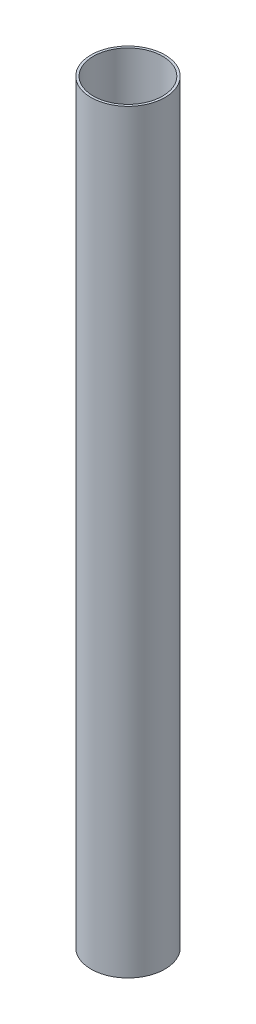
ISO-10303-21;
HEADER;
FILE_DESCRIPTION(('STEP AP214'),'2;1');
FILE_NAME('part.step','',(''),(''),'','','');
FILE_SCHEMA(('AUTOMOTIVE_DESIGN { 1 0 10303 214 1 1 1 1 }'));
ENDSEC;
DATA;
#1=APPLICATION_CONTEXT('core data for automotive mechanical design processes');
#2=APPLICATION_PROTOCOL_DEFINITION('international standard','automotive_design',2000,#1);
#3=PRODUCT_CONTEXT('',#1,'mechanical');
#4=PRODUCT('Part','Part','',(#3));
#5=PRODUCT_RELATED_PRODUCT_CATEGORY('part','',(#4));
#6=PRODUCT_DEFINITION_FORMATION('','',#4);
#7=PRODUCT_DEFINITION_CONTEXT('part definition',#1,'design');
#8=PRODUCT_DEFINITION('design','',#6,#7);
#9=PRODUCT_DEFINITION_SHAPE('','',#8);
#10=(LENGTH_UNIT() NAMED_UNIT(*) SI_UNIT(.MILLI.,.METRE.));
#11=(NAMED_UNIT(*) PLANE_ANGLE_UNIT() SI_UNIT($,.RADIAN.));
#12=(NAMED_UNIT(*) SI_UNIT($,.STERADIAN.) SOLID_ANGLE_UNIT());
#13=UNCERTAINTY_MEASURE_WITH_UNIT(LENGTH_MEASURE(1.E-05),#10,'distance_accuracy_value','');
#14=(GEOMETRIC_REPRESENTATION_CONTEXT(3) GLOBAL_UNCERTAINTY_ASSIGNED_CONTEXT((#13)) GLOBAL_UNIT_ASSIGNED_CONTEXT((#10,
#11,#12)) REPRESENTATION_CONTEXT('',''));
#15=CARTESIAN_POINT('',(0.,0.,0.));
#16=DIRECTION('',(0.,0.,1.));
#17=DIRECTION('',(1.,0.,0.));
#18=AXIS2_PLACEMENT_3D('',#15,#16,#17);
#19=CARTESIAN_POINT('',(0.,936.625,0.));
#20=DIRECTION('',(0.,1.,0.));
#21=DIRECTION('',(0.,0.,1.));
#22=AXIS2_PLACEMENT_3D('',#19,#20,#21);
#23=PLANE('',#22);
#24=CARTESIAN_POINT('',(0.,936.625,0.));
#25=DIRECTION('',(0.,1.,0.));
#26=DIRECTION('',(0.,0.,1.));
#27=AXIS2_PLACEMENT_3D('',#24,#25,#26);
#28=CIRCLE('',#27,45.847);
#29=CARTESIAN_POINT('',(0.,936.625,45.847));
#30=VERTEX_POINT('',#29);
#31=EDGE_CURVE('E10',#30,#30,#28,.T.);
#32=ORIENTED_EDGE('',*,*,#31,.T.);
#33=EDGE_LOOP('',(#32));
#34=FACE_BOUND('',#33,.T.);
#35=CARTESIAN_POINT('',(0.,936.625,0.));
#36=DIRECTION('',(0.,1.,0.));
#37=DIRECTION('',(0.,0.,1.));
#38=AXIS2_PLACEMENT_3D('',#35,#36,#37);
#39=CIRCLE('',#38,42.926);
#40=CARTESIAN_POINT('',(0.,936.625,42.926));
#41=VERTEX_POINT('',#40);
#42=EDGE_CURVE('E43',#41,#41,#39,.T.);
#43=ORIENTED_EDGE('',*,*,#42,.F.);
#44=EDGE_LOOP('',(#43));
#45=FACE_BOUND('',#44,.T.);
#46=ADVANCED_FACE('F32',(#34,#45),#23,.T.);
#47=CARTESIAN_POINT('',(0.,0.,0.));
#48=DIRECTION('',(0.,1.,0.));
#49=DIRECTION('',(0.,0.,1.));
#50=AXIS2_PLACEMENT_3D('',#47,#48,#49);
#51=PLANE('',#50);
#52=CARTESIAN_POINT('',(0.,0.,0.));
#53=DIRECTION('',(0.,1.,0.));
#54=DIRECTION('',(0.,0.,1.));
#55=AXIS2_PLACEMENT_3D('',#52,#53,#54);
#56=CIRCLE('',#55,45.847);
#57=CARTESIAN_POINT('',(0.,0.,45.847));
#58=VERTEX_POINT('',#57);
#59=EDGE_CURVE('E36',#58,#58,#56,.T.);
#60=ORIENTED_EDGE('',*,*,#59,.F.);
#61=EDGE_LOOP('',(#60));
#62=FACE_BOUND('',#61,.T.);
#63=CARTESIAN_POINT('',(0.,0.,0.));
#64=DIRECTION('',(0.,1.,0.));
#65=DIRECTION('',(0.,0.,1.));
#66=AXIS2_PLACEMENT_3D('',#63,#64,#65);
#67=CIRCLE('',#66,42.926);
#68=CARTESIAN_POINT('',(0.,0.,42.926));
#69=VERTEX_POINT('',#68);
#70=EDGE_CURVE('E45',#69,#69,#67,.T.);
#71=ORIENTED_EDGE('',*,*,#70,.T.);
#72=EDGE_LOOP('',(#71));
#73=FACE_BOUND('',#72,.T.);
#74=ADVANCED_FACE('F55',(#62,#73),#51,.F.);
#75=CARTESIAN_POINT('',(0.,936.625,0.));
#76=DIRECTION('',(0.,-1.,0.));
#77=DIRECTION('',(0.,0.,-1.));
#78=AXIS2_PLACEMENT_3D('',#75,#76,#77);
#79=CYLINDRICAL_SURFACE('',#78,45.847);
#80=ORIENTED_EDGE('',*,*,#31,.F.);
#81=EDGE_LOOP('',(#80));
#82=FACE_BOUND('',#81,.T.);
#83=ORIENTED_EDGE('',*,*,#59,.T.);
#84=EDGE_LOOP('',(#83));
#85=FACE_BOUND('',#84,.T.);
#86=ADVANCED_FACE('F34',(#82,#85),#79,.T.);
#87=CARTESIAN_POINT('',(0.,936.625,0.));
#88=DIRECTION('',(0.,-1.,0.));
#89=DIRECTION('',(0.,0.,-1.));
#90=AXIS2_PLACEMENT_3D('',#87,#88,#89);
#91=CYLINDRICAL_SURFACE('',#90,42.926);
#92=ORIENTED_EDGE('',*,*,#42,.T.);
#93=EDGE_LOOP('',(#92));
#94=FACE_BOUND('',#93,.T.);
#95=ORIENTED_EDGE('',*,*,#70,.F.);
#96=EDGE_LOOP('',(#95));
#97=FACE_BOUND('',#96,.T.);
#98=ADVANCED_FACE('F51',(#94,#97),#91,.F.);
#99=CLOSED_SHELL('',(#46,#74,#86,#98));
#100=MANIFOLD_SOLID_BREP('B2',#99);
#101=ADVANCED_BREP_SHAPE_REPRESENTATION('',(#18,#100),#14);
#102=SHAPE_DEFINITION_REPRESENTATION(#9,#101);
ENDSEC;
END-ISO-10303-21;
